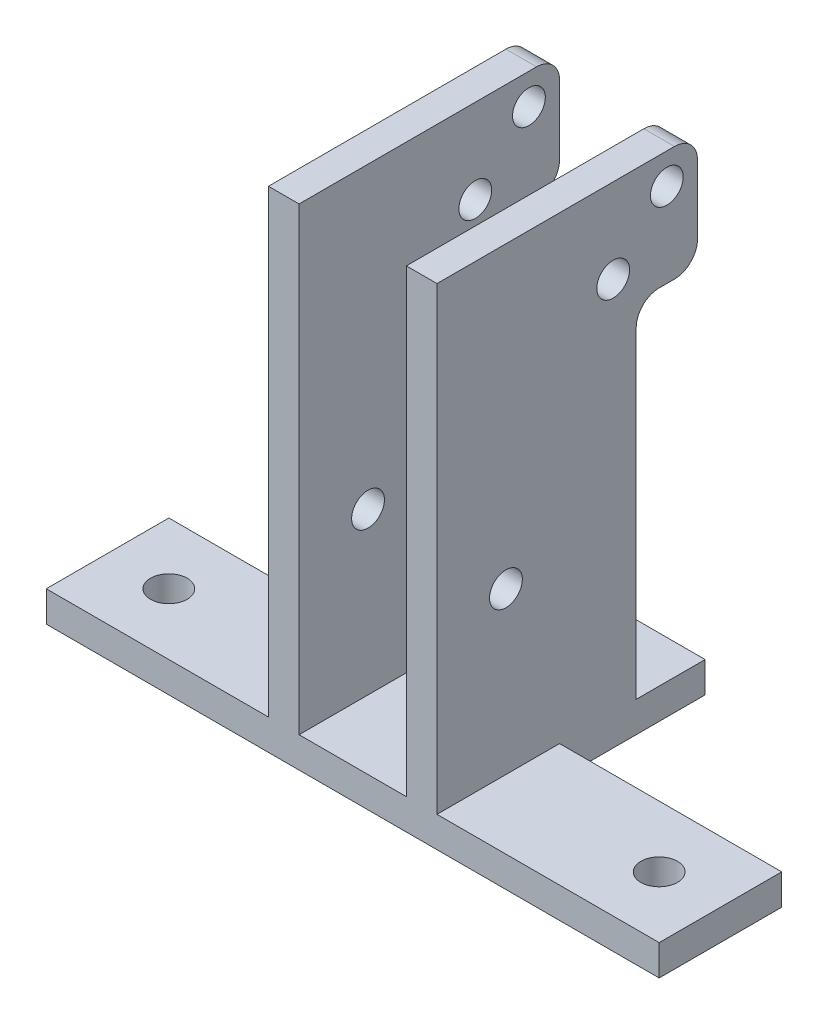
ISO-10303-21;
HEADER;
FILE_DESCRIPTION(('STEP AP214'),'2;1');
FILE_NAME('part.step','',(''),(''),'','','');
FILE_SCHEMA(('AUTOMOTIVE_DESIGN { 1 0 10303 214 1 1 1 1 }'));
ENDSEC;
DATA;
#1=APPLICATION_CONTEXT('core data for automotive mechanical design processes');
#2=APPLICATION_PROTOCOL_DEFINITION('international standard','automotive_design',2000,#1);
#3=PRODUCT_CONTEXT('',#1,'mechanical');
#4=PRODUCT('Part','Part','',(#3));
#5=PRODUCT_RELATED_PRODUCT_CATEGORY('part','',(#4));
#6=PRODUCT_DEFINITION_FORMATION('','',#4);
#7=PRODUCT_DEFINITION_CONTEXT('part definition',#1,'design');
#8=PRODUCT_DEFINITION('design','',#6,#7);
#9=PRODUCT_DEFINITION_SHAPE('','',#8);
#10=(LENGTH_UNIT() NAMED_UNIT(*) SI_UNIT(.MILLI.,.METRE.));
#11=(NAMED_UNIT(*) PLANE_ANGLE_UNIT() SI_UNIT($,.RADIAN.));
#12=(NAMED_UNIT(*) SI_UNIT($,.STERADIAN.) SOLID_ANGLE_UNIT());
#13=UNCERTAINTY_MEASURE_WITH_UNIT(LENGTH_MEASURE(1.E-05),#10,'distance_accuracy_value','');
#14=(GEOMETRIC_REPRESENTATION_CONTEXT(3) GLOBAL_UNCERTAINTY_ASSIGNED_CONTEXT((#13)) GLOBAL_UNIT_ASSIGNED_CONTEXT((#10,
#11,#12)) REPRESENTATION_CONTEXT('',''));
#15=CARTESIAN_POINT('',(0.,0.,0.));
#16=DIRECTION('',(0.,0.,1.));
#17=DIRECTION('',(1.,0.,0.));
#18=AXIS2_PLACEMENT_3D('',#15,#16,#17);
#19=CARTESIAN_POINT('',(-8.73125,44.45,-14.2875));
#20=DIRECTION('',(0.,0.,-1.));
#21=DIRECTION('',(-1.,0.,0.));
#22=AXIS2_PLACEMENT_3D('',#19,#20,#21);
#23=PLANE('',#22);
#24=DIRECTION('',(0.,-1.,0.));
#25=VECTOR('',#24,1.);
#26=CARTESIAN_POINT('',(-8.73125,44.45,-14.2875));
#27=LINE('',#26,#25);
#28=CARTESIAN_POINT('',(-8.73125,38.89375,-14.2875));
#29=VERTEX_POINT('',#28);
#30=CARTESIAN_POINT('',(-8.73125,3.175,-14.2875));
#31=VERTEX_POINT('',#30);
#32=EDGE_CURVE('E323',#29,#31,#27,.T.);
#33=ORIENTED_EDGE('',*,*,#32,.F.);
#34=DIRECTION('',(-1.,0.,0.));
#35=VECTOR('',#34,1.);
#36=CARTESIAN_POINT('',(-5.55625,38.89375,-14.2875));
#37=LINE('',#36,#35);
#38=CARTESIAN_POINT('',(-5.55625,38.89375,-14.2875));
#39=VERTEX_POINT('',#38);
#40=EDGE_CURVE('E233',#39,#29,#37,.T.);
#41=ORIENTED_EDGE('',*,*,#40,.F.);
#42=DIRECTION('',(0.,-1.,0.));
#43=VECTOR('',#42,1.);
#44=CARTESIAN_POINT('',(-5.55625,44.45,-14.2875));
#45=LINE('',#44,#43);
#46=CARTESIAN_POINT('',(-5.55625,3.175,-14.2875));
#47=VERTEX_POINT('',#46);
#48=EDGE_CURVE('E222',#39,#47,#45,.T.);
#49=ORIENTED_EDGE('',*,*,#48,.T.);
#50=DIRECTION('',(-1.,0.,0.));
#51=VECTOR('',#50,1.);
#52=CARTESIAN_POINT('',(0.,3.175,-14.2875));
#53=LINE('',#52,#51);
#54=EDGE_CURVE('E325',#47,#31,#53,.T.);
#55=ORIENTED_EDGE('',*,*,#54,.T.);
#56=EDGE_LOOP('',(#33,#41,#49,#55));
#57=FACE_BOUND('',#56,.T.);
#58=ADVANCED_FACE('F41',(#57),#23,.T.);
#59=CARTESIAN_POINT('',(0.,3.175,0.));
#60=DIRECTION('',(0.,1.,0.));
#61=DIRECTION('',(0.,0.,1.));
#62=AXIS2_PLACEMENT_3D('',#59,#60,#61);
#63=PLANE('',#62);
#64=DIRECTION('',(0.,0.,1.));
#65=VECTOR('',#64,1.);
#66=CARTESIAN_POINT('',(-8.73125,3.175,0.));
#67=LINE('',#66,#65);
#68=CARTESIAN_POINT('',(-8.73125,3.175,-6.35));
#69=VERTEX_POINT('',#68);
#70=CARTESIAN_POINT('',(-8.73125,3.175,6.35));
#71=VERTEX_POINT('',#70);
#72=EDGE_CURVE('E337',#69,#71,#67,.T.);
#73=ORIENTED_EDGE('',*,*,#72,.F.);
#74=DIRECTION('',(1.,0.,0.));
#75=VECTOR('',#74,1.);
#76=CARTESIAN_POINT('',(0.,3.175,-6.35));
#77=LINE('',#76,#75);
#78=CARTESIAN_POINT('',(-31.75,3.175,-6.35));
#79=VERTEX_POINT('',#78);
#80=EDGE_CURVE('E428',#79,#69,#77,.T.);
#81=ORIENTED_EDGE('',*,*,#80,.F.);
#82=DIRECTION('',(0.,0.,-1.));
#83=VECTOR('',#82,1.);
#84=CARTESIAN_POINT('',(-31.75,3.175,0.));
#85=LINE('',#84,#83);
#86=CARTESIAN_POINT('',(-31.75,3.175,6.35));
#87=VERTEX_POINT('',#86);
#88=EDGE_CURVE('E432',#87,#79,#85,.T.);
#89=ORIENTED_EDGE('',*,*,#88,.F.);
#90=DIRECTION('',(1.,0.,0.));
#91=VECTOR('',#90,1.);
#92=CARTESIAN_POINT('',(0.,3.175,6.35));
#93=LINE('',#92,#91);
#94=EDGE_CURVE('E419',#87,#71,#93,.T.);
#95=ORIENTED_EDGE('',*,*,#94,.T.);
#96=EDGE_LOOP('',(#73,#81,#89,#95));
#97=FACE_BOUND('',#96,.T.);
#98=CARTESIAN_POINT('',(-25.4,3.175,0.));
#99=DIRECTION('',(0.,-1.,0.));
#100=DIRECTION('',(0.,0.,-1.));
#101=AXIS2_PLACEMENT_3D('',#98,#99,#100);
#102=CIRCLE('',#101,1.89865);
#103=CARTESIAN_POINT('',(-25.4,3.175,-1.89865));
#104=VERTEX_POINT('',#103);
#105=EDGE_CURVE('E406',#104,#104,#102,.T.);
#106=ORIENTED_EDGE('',*,*,#105,.T.);
#107=EDGE_LOOP('',(#106));
#108=FACE_BOUND('',#107,.T.);
#109=ADVANCED_FACE('F629',(#97,#108),#63,.T.);
#110=DIRECTION('',(0.,0.,-1.));
#111=VECTOR('',#110,1.);
#112=CARTESIAN_POINT('',(8.73125,3.175,0.));
#113=LINE('',#112,#111);
#114=CARTESIAN_POINT('',(8.73125,3.175,6.35));
#115=VERTEX_POINT('',#114);
#116=CARTESIAN_POINT('',(8.73125,3.175,-6.35));
#117=VERTEX_POINT('',#116);
#118=EDGE_CURVE('E362',#115,#117,#113,.T.);
#119=ORIENTED_EDGE('',*,*,#118,.F.);
#120=CARTESIAN_POINT('',(31.75,3.175,6.35));
#121=VERTEX_POINT('',#120);
#122=EDGE_CURVE('E423',#115,#121,#93,.T.);
#123=ORIENTED_EDGE('',*,*,#122,.T.);
#124=DIRECTION('',(0.,0.,-1.));
#125=VECTOR('',#124,1.);
#126=CARTESIAN_POINT('',(31.75,3.175,0.));
#127=LINE('',#126,#125);
#128=CARTESIAN_POINT('',(31.75,3.175,-6.35));
#129=VERTEX_POINT('',#128);
#130=EDGE_CURVE('E422',#121,#129,#127,.T.);
#131=ORIENTED_EDGE('',*,*,#130,.T.);
#132=EDGE_CURVE('E427',#117,#129,#77,.T.);
#133=ORIENTED_EDGE('',*,*,#132,.F.);
#134=EDGE_LOOP('',(#119,#123,#131,#133));
#135=FACE_BOUND('',#134,.T.);
#136=CARTESIAN_POINT('',(25.4,3.175,0.));
#137=DIRECTION('',(0.,-1.,0.));
#138=DIRECTION('',(0.,0.,-1.));
#139=AXIS2_PLACEMENT_3D('',#136,#137,#138);
#140=CIRCLE('',#139,1.89865);
#141=CARTESIAN_POINT('',(25.4,3.175,-1.89865));
#142=VERTEX_POINT('',#141);
#143=EDGE_CURVE('E414',#142,#142,#140,.T.);
#144=ORIENTED_EDGE('',*,*,#143,.T.);
#145=EDGE_LOOP('',(#144));
#146=FACE_BOUND('',#145,.T.);
#147=ADVANCED_FACE('F573',(#135,#146),#63,.T.);
#148=CARTESIAN_POINT('',(0.,3.175,-6.35));
#149=DIRECTION('',(0.,0.,-1.));
#150=DIRECTION('',(-1.,0.,0.));
#151=AXIS2_PLACEMENT_3D('',#148,#149,#150);
#152=PLANE('',#151);
#153=DIRECTION('',(0.,-1.,0.));
#154=VECTOR('',#153,1.);
#155=CARTESIAN_POINT('',(8.73125,3.175,-6.35));
#156=LINE('',#155,#154);
#157=CARTESIAN_POINT('',(8.73125,0.,-6.35));
#158=VERTEX_POINT('',#157);
#159=EDGE_CURVE('E398',#117,#158,#156,.T.);
#160=ORIENTED_EDGE('',*,*,#159,.F.);
#161=ORIENTED_EDGE('',*,*,#132,.T.);
#162=DIRECTION('',(0.,-1.,0.));
#163=VECTOR('',#162,1.);
#164=CARTESIAN_POINT('',(31.75,3.175,-6.35));
#165=LINE('',#164,#163);
#166=CARTESIAN_POINT('',(31.75,0.,-6.35));
#167=VERTEX_POINT('',#166);
#168=EDGE_CURVE('E457',#129,#167,#165,.T.);
#169=ORIENTED_EDGE('',*,*,#168,.T.);
#170=DIRECTION('',(1.,0.,0.));
#171=VECTOR('',#170,1.);
#172=CARTESIAN_POINT('',(0.,0.,-6.35));
#173=LINE('',#172,#171);
#174=EDGE_CURVE('E443',#158,#167,#173,.T.);
#175=ORIENTED_EDGE('',*,*,#174,.F.);
#176=EDGE_LOOP('',(#160,#161,#169,#175));
#177=FACE_BOUND('',#176,.T.);
#178=ADVANCED_FACE('F541',(#177),#152,.T.);
#179=CARTESIAN_POINT('',(0.,3.175,6.35));
#180=DIRECTION('',(0.,0.,-1.));
#181=DIRECTION('',(-1.,0.,0.));
#182=AXIS2_PLACEMENT_3D('',#179,#180,#181);
#183=PLANE('',#182);
#184=CARTESIAN_POINT('',(-5.55625,3.175,6.35));
#185=VERTEX_POINT('',#184);
#186=CARTESIAN_POINT('',(5.55625,3.175,6.35));
#187=VERTEX_POINT('',#186);
#188=EDGE_CURVE('E217',#185,#187,#93,.T.);
#189=ORIENTED_EDGE('',*,*,#188,.F.);
#190=DIRECTION('',(0.,-1.,0.));
#191=VECTOR('',#190,1.);
#192=CARTESIAN_POINT('',(-5.55625,44.45,6.35));
#193=LINE('',#192,#191);
#194=CARTESIAN_POINT('',(-5.55625,50.8,6.35));
#195=VERTEX_POINT('',#194);
#196=EDGE_CURVE('E210',#195,#185,#193,.T.);
#197=ORIENTED_EDGE('',*,*,#196,.F.);
#198=DIRECTION('',(-1.,0.,0.));
#199=VECTOR('',#198,1.);
#200=CARTESIAN_POINT('',(-5.55625,50.8,6.35));
#201=LINE('',#200,#199);
#202=CARTESIAN_POINT('',(-8.73125,50.8,6.35));
#203=VERTEX_POINT('',#202);
#204=EDGE_CURVE('E214',#195,#203,#201,.T.);
#205=ORIENTED_EDGE('',*,*,#204,.T.);
#206=DIRECTION('',(0.,-1.,0.));
#207=VECTOR('',#206,1.);
#208=CARTESIAN_POINT('',(-8.73125,44.45,6.35));
#209=LINE('',#208,#207);
#210=EDGE_CURVE('E221',#203,#71,#209,.T.);
#211=ORIENTED_EDGE('',*,*,#210,.T.);
#212=ORIENTED_EDGE('',*,*,#94,.F.);
#213=DIRECTION('',(0.,-1.,0.));
#214=VECTOR('',#213,1.);
#215=CARTESIAN_POINT('',(-31.75,3.175,6.35));
#216=LINE('',#215,#214);
#217=CARTESIAN_POINT('',(-31.75,0.,6.35));
#218=VERTEX_POINT('',#217);
#219=EDGE_CURVE('E436',#87,#218,#216,.T.);
#220=ORIENTED_EDGE('',*,*,#219,.T.);
#221=DIRECTION('',(1.,0.,0.));
#222=VECTOR('',#221,1.);
#223=CARTESIAN_POINT('',(0.,0.,6.35));
#224=LINE('',#223,#222);
#225=CARTESIAN_POINT('',(31.75,0.,6.35));
#226=VERTEX_POINT('',#225);
#227=EDGE_CURVE('E418',#218,#226,#224,.T.);
#228=ORIENTED_EDGE('',*,*,#227,.T.);
#229=DIRECTION('',(0.,-1.,0.));
#230=VECTOR('',#229,1.);
#231=CARTESIAN_POINT('',(31.75,3.175,6.35));
#232=LINE('',#231,#230);
#233=EDGE_CURVE('E461',#121,#226,#232,.T.);
#234=ORIENTED_EDGE('',*,*,#233,.F.);
#235=ORIENTED_EDGE('',*,*,#122,.F.);
#236=DIRECTION('',(0.,-1.,0.));
#237=VECTOR('',#236,1.);
#238=CARTESIAN_POINT('',(8.73125,44.45,6.35));
#239=LINE('',#238,#237);
#240=CARTESIAN_POINT('',(8.73125,50.8,6.35));
#241=VERTEX_POINT('',#240);
#242=EDGE_CURVE('E341',#241,#115,#239,.T.);
#243=ORIENTED_EDGE('',*,*,#242,.F.);
#244=DIRECTION('',(1.,0.,0.));
#245=VECTOR('',#244,1.);
#246=CARTESIAN_POINT('',(5.55625,50.8,6.35));
#247=LINE('',#246,#245);
#248=CARTESIAN_POINT('',(5.55625,50.8,6.35));
#249=VERTEX_POINT('',#248);
#250=EDGE_CURVE('E279',#249,#241,#247,.T.);
#251=ORIENTED_EDGE('',*,*,#250,.F.);
#252=DIRECTION('',(0.,-1.,0.));
#253=VECTOR('',#252,1.);
#254=CARTESIAN_POINT('',(5.55625,44.45,6.35));
#255=LINE('',#254,#253);
#256=EDGE_CURVE('E349',#249,#187,#255,.T.);
#257=ORIENTED_EDGE('',*,*,#256,.T.);
#258=EDGE_LOOP('',(#189,#197,#205,#211,#212,#220,#228,#234,#235,#243,#251,#257));
#259=FACE_BOUND('',#258,.T.);
#260=ADVANCED_FACE('F212',(#259),#183,.F.);
#261=CARTESIAN_POINT('',(31.75,3.175,0.));
#262=DIRECTION('',(-1.,0.,0.));
#263=DIRECTION('',(0.,0.,1.));
#264=AXIS2_PLACEMENT_3D('',#261,#262,#263);
#265=PLANE('',#264);
#266=DIRECTION('',(0.,0.,-1.));
#267=VECTOR('',#266,1.);
#268=CARTESIAN_POINT('',(31.75,0.,0.));
#269=LINE('',#268,#267);
#270=EDGE_CURVE('E439',#226,#167,#269,.T.);
#271=ORIENTED_EDGE('',*,*,#270,.T.);
#272=ORIENTED_EDGE('',*,*,#168,.F.);
#273=ORIENTED_EDGE('',*,*,#130,.F.);
#274=ORIENTED_EDGE('',*,*,#233,.T.);
#275=EDGE_LOOP('',(#271,#272,#273,#274));
#276=FACE_BOUND('',#275,.T.);
#277=ADVANCED_FACE('F545',(#276),#265,.F.);
#278=DIRECTION('',(0.,1.,0.));
#279=VECTOR('',#278,1.);
#280=CARTESIAN_POINT('',(-8.73125,3.175,-6.35));
#281=LINE('',#280,#279);
#282=CARTESIAN_POINT('',(-8.73125,0.,-6.35));
#283=VERTEX_POINT('',#282);
#284=EDGE_CURVE('E391',#283,#69,#281,.T.);
#285=ORIENTED_EDGE('',*,*,#284,.F.);
#286=CARTESIAN_POINT('',(-31.75,0.,-6.35));
#287=VERTEX_POINT('',#286);
#288=EDGE_CURVE('E444',#287,#283,#173,.T.);
#289=ORIENTED_EDGE('',*,*,#288,.F.);
#290=DIRECTION('',(0.,-1.,0.));
#291=VECTOR('',#290,1.);
#292=CARTESIAN_POINT('',(-31.75,3.175,-6.35));
#293=LINE('',#292,#291);
#294=EDGE_CURVE('E454',#79,#287,#293,.T.);
#295=ORIENTED_EDGE('',*,*,#294,.F.);
#296=ORIENTED_EDGE('',*,*,#80,.T.);
#297=EDGE_LOOP('',(#285,#289,#295,#296));
#298=FACE_BOUND('',#297,.T.);
#299=ADVANCED_FACE('F557',(#298),#152,.T.);
#300=CARTESIAN_POINT('',(-31.75,3.175,0.));
#301=DIRECTION('',(-1.,0.,0.));
#302=DIRECTION('',(0.,0.,1.));
#303=AXIS2_PLACEMENT_3D('',#300,#301,#302);
#304=PLANE('',#303);
#305=DIRECTION('',(0.,0.,-1.));
#306=VECTOR('',#305,1.);
#307=CARTESIAN_POINT('',(-31.75,0.,0.));
#308=LINE('',#307,#306);
#309=EDGE_CURVE('E448',#218,#287,#308,.T.);
#310=ORIENTED_EDGE('',*,*,#309,.F.);
#311=ORIENTED_EDGE('',*,*,#219,.F.);
#312=ORIENTED_EDGE('',*,*,#88,.T.);
#313=ORIENTED_EDGE('',*,*,#294,.T.);
#314=EDGE_LOOP('',(#310,#311,#312,#313));
#315=FACE_BOUND('',#314,.T.);
#316=ADVANCED_FACE('F551',(#315),#304,.T.);
#317=DIRECTION('',(0.,0.,-1.));
#318=VECTOR('',#317,1.);
#319=CARTESIAN_POINT('',(-5.55625,3.175,0.));
#320=LINE('',#319,#318);
#321=EDGE_CURVE('E334',#185,#47,#320,.T.);
#322=ORIENTED_EDGE('',*,*,#321,.F.);
#323=ORIENTED_EDGE('',*,*,#188,.T.);
#324=DIRECTION('',(0.,0.,1.));
#325=VECTOR('',#324,1.);
#326=CARTESIAN_POINT('',(5.55625,3.175,0.));
#327=LINE('',#326,#325);
#328=CARTESIAN_POINT('',(5.55625,3.175,-14.2875));
#329=VERTEX_POINT('',#328);
#330=EDGE_CURVE('E358',#329,#187,#327,.T.);
#331=ORIENTED_EDGE('',*,*,#330,.F.);
#332=DIRECTION('',(-1.,0.,0.));
#333=VECTOR('',#332,1.);
#334=CARTESIAN_POINT('',(0.,3.175,-14.2875));
#335=LINE('',#334,#333);
#336=CARTESIAN_POINT('',(8.73125,3.175,-14.2875));
#337=VERTEX_POINT('',#336);
#338=EDGE_CURVE('E345',#337,#329,#335,.T.);
#339=ORIENTED_EDGE('',*,*,#338,.F.);
#340=DIRECTION('',(0.,0.,1.));
#341=VECTOR('',#340,1.);
#342=CARTESIAN_POINT('',(8.73125,3.175,6.35));
#343=LINE('',#342,#341);
#344=CARTESIAN_POINT('',(8.73125,3.175,-21.43125));
#345=VERTEX_POINT('',#344);
#346=EDGE_CURVE('E367',#345,#337,#343,.T.);
#347=ORIENTED_EDGE('',*,*,#346,.F.);
#348=DIRECTION('',(1.,0.,0.));
#349=VECTOR('',#348,1.);
#350=CARTESIAN_POINT('',(8.73125,3.175,-21.43125));
#351=LINE('',#350,#349);
#352=CARTESIAN_POINT('',(-8.73125,3.175,-21.43125));
#353=VERTEX_POINT('',#352);
#354=EDGE_CURVE('E375',#353,#345,#351,.T.);
#355=ORIENTED_EDGE('',*,*,#354,.F.);
#356=DIRECTION('',(0.,0.,-1.));
#357=VECTOR('',#356,1.);
#358=CARTESIAN_POINT('',(-8.73125,3.175,6.35));
#359=LINE('',#358,#357);
#360=EDGE_CURVE('E371',#31,#353,#359,.T.);
#361=ORIENTED_EDGE('',*,*,#360,.F.);
#362=ORIENTED_EDGE('',*,*,#54,.F.);
#363=EDGE_LOOP('',(#322,#323,#331,#339,#347,#355,#361,#362));
#364=FACE_BOUND('',#363,.T.);
#365=ADVANCED_FACE('F611',(#364),#63,.T.);
#366=CARTESIAN_POINT('',(0.,0.,0.));
#367=DIRECTION('',(0.,1.,0.));
#368=DIRECTION('',(0.,0.,1.));
#369=AXIS2_PLACEMENT_3D('',#366,#367,#368);
#370=PLANE('',#369);
#371=ORIENTED_EDGE('',*,*,#270,.F.);
#372=ORIENTED_EDGE('',*,*,#227,.F.);
#373=ORIENTED_EDGE('',*,*,#309,.T.);
#374=ORIENTED_EDGE('',*,*,#288,.T.);
#375=DIRECTION('',(0.,0.,-1.));
#376=VECTOR('',#375,1.);
#377=CARTESIAN_POINT('',(-8.73125,0.,6.35));
#378=LINE('',#377,#376);
#379=CARTESIAN_POINT('',(-8.73125,0.,-21.43125));
#380=VERTEX_POINT('',#379);
#381=EDGE_CURVE('E382',#283,#380,#378,.T.);
#382=ORIENTED_EDGE('',*,*,#381,.T.);
#383=DIRECTION('',(1.,0.,0.));
#384=VECTOR('',#383,1.);
#385=CARTESIAN_POINT('',(8.73125,0.,-21.43125));
#386=LINE('',#385,#384);
#387=CARTESIAN_POINT('',(8.73125,0.,-21.43125));
#388=VERTEX_POINT('',#387);
#389=EDGE_CURVE('E372',#380,#388,#386,.T.);
#390=ORIENTED_EDGE('',*,*,#389,.T.);
#391=DIRECTION('',(0.,0.,1.));
#392=VECTOR('',#391,1.);
#393=CARTESIAN_POINT('',(8.73125,0.,6.35));
#394=LINE('',#393,#392);
#395=EDGE_CURVE('E366',#388,#158,#394,.T.);
#396=ORIENTED_EDGE('',*,*,#395,.T.);
#397=ORIENTED_EDGE('',*,*,#174,.T.);
#398=EDGE_LOOP('',(#371,#372,#373,#374,#382,#390,#396,#397));
#399=FACE_BOUND('',#398,.T.);
#400=CARTESIAN_POINT('',(25.4,0.,0.));
#401=DIRECTION('',(0.,-1.,0.));
#402=DIRECTION('',(0.,0.,-1.));
#403=AXIS2_PLACEMENT_3D('',#400,#401,#402);
#404=CIRCLE('',#403,1.89864999999999);
#405=CARTESIAN_POINT('',(25.4,0.,-1.89864999999999));
#406=VERTEX_POINT('',#405);
#407=EDGE_CURVE('E410',#406,#406,#404,.T.);
#408=ORIENTED_EDGE('',*,*,#407,.F.);
#409=EDGE_LOOP('',(#408));
#410=FACE_BOUND('',#409,.T.);
#411=CARTESIAN_POINT('',(-25.4,0.,0.));
#412=DIRECTION('',(0.,-1.,0.));
#413=DIRECTION('',(0.,0.,-1.));
#414=AXIS2_PLACEMENT_3D('',#411,#412,#413);
#415=CIRCLE('',#414,1.89864999999999);
#416=CARTESIAN_POINT('',(-25.4,0.,-1.89864999999999));
#417=VERTEX_POINT('',#416);
#418=EDGE_CURVE('E402',#417,#417,#415,.T.);
#419=ORIENTED_EDGE('',*,*,#418,.F.);
#420=EDGE_LOOP('',(#419));
#421=FACE_BOUND('',#420,.T.);
#422=ADVANCED_FACE('F535',(#399,#410,#421),#370,.F.);
#423=CARTESIAN_POINT('',(25.4,0.,0.));
#424=DIRECTION('',(0.,-1.,0.));
#425=DIRECTION('',(0.,0.,-1.));
#426=AXIS2_PLACEMENT_3D('',#423,#424,#425);
#427=CYLINDRICAL_SURFACE('',#426,1.89864999999999);
#428=ORIENTED_EDGE('',*,*,#143,.F.);
#429=EDGE_LOOP('',(#428));
#430=FACE_BOUND('',#429,.T.);
#431=ORIENTED_EDGE('',*,*,#407,.T.);
#432=EDGE_LOOP('',(#431));
#433=FACE_BOUND('',#432,.T.);
#434=ADVANCED_FACE('F638',(#430,#433),#427,.F.);
#435=CARTESIAN_POINT('',(-25.4,0.,0.));
#436=DIRECTION('',(0.,-1.,0.));
#437=DIRECTION('',(0.,0.,-1.));
#438=AXIS2_PLACEMENT_3D('',#435,#436,#437);
#439=CYLINDRICAL_SURFACE('',#438,1.89864999999999);
#440=ORIENTED_EDGE('',*,*,#105,.F.);
#441=EDGE_LOOP('',(#440));
#442=FACE_BOUND('',#441,.T.);
#443=ORIENTED_EDGE('',*,*,#418,.T.);
#444=EDGE_LOOP('',(#443));
#445=FACE_BOUND('',#444,.T.);
#446=ADVANCED_FACE('F635',(#442,#445),#439,.F.);
#447=CARTESIAN_POINT('',(8.73125,3.175,6.35));
#448=DIRECTION('',(1.,0.,0.));
#449=DIRECTION('',(0.,0.,-1.));
#450=AXIS2_PLACEMENT_3D('',#447,#448,#449);
#451=PLANE('',#450);
#452=CARTESIAN_POINT('',(8.73125,47.625,-17.4625));
#453=DIRECTION('',(1.,0.,0.));
#454=DIRECTION('',(0.,0.,-1.));
#455=AXIS2_PLACEMENT_3D('',#452,#453,#454);
#456=CIRCLE('',#455,1.69999999999999);
#457=CARTESIAN_POINT('',(8.73125,47.625,-19.1625));
#458=VERTEX_POINT('',#457);
#459=EDGE_CURVE('E260',#458,#458,#456,.T.);
#460=ORIENTED_EDGE('',*,*,#459,.F.);
#461=EDGE_LOOP('',(#460));
#462=FACE_BOUND('',#461,.T.);
#463=DIRECTION('',(0.,-1.,0.));
#464=VECTOR('',#463,1.);
#465=CARTESIAN_POINT('',(8.73125,0.,-20.6375));
#466=LINE('',#465,#464);
#467=CARTESIAN_POINT('',(8.73125,48.41875,-20.6375));
#468=VERTEX_POINT('',#467);
#469=CARTESIAN_POINT('',(8.73125,41.275,-20.6375));
#470=VERTEX_POINT('',#469);
#471=EDGE_CURVE('E284',#468,#470,#466,.T.);
#472=ORIENTED_EDGE('',*,*,#471,.F.);
#473=CARTESIAN_POINT('',(8.73125,48.41875,-18.25625));
#474=DIRECTION('',(1.,0.,0.));
#475=DIRECTION('',(0.,0.,-1.));
#476=AXIS2_PLACEMENT_3D('',#473,#474,#475);
#477=CIRCLE('',#476,2.38125);
#478=CARTESIAN_POINT('',(8.73125,50.8,-18.25625));
#479=VERTEX_POINT('',#478);
#480=EDGE_CURVE('E478',#468,#479,#477,.T.);
#481=ORIENTED_EDGE('',*,*,#480,.T.);
#482=DIRECTION('',(0.,0.,-1.));
#483=VECTOR('',#482,1.);
#484=CARTESIAN_POINT('',(8.73125,50.8,0.));
#485=LINE('',#484,#483);
#486=EDGE_CURVE('E271',#241,#479,#485,.T.);
#487=ORIENTED_EDGE('',*,*,#486,.F.);
#488=ORIENTED_EDGE('',*,*,#242,.T.);
#489=ORIENTED_EDGE('',*,*,#118,.T.);
#490=ORIENTED_EDGE('',*,*,#159,.T.);
#491=ORIENTED_EDGE('',*,*,#395,.F.);
#492=DIRECTION('',(0.,-1.,0.));
#493=VECTOR('',#492,1.);
#494=CARTESIAN_POINT('',(8.73125,3.175,-21.43125));
#495=LINE('',#494,#493);
#496=EDGE_CURVE('E388',#345,#388,#495,.T.);
#497=ORIENTED_EDGE('',*,*,#496,.F.);
#498=ORIENTED_EDGE('',*,*,#346,.T.);
#499=DIRECTION('',(0.,-1.,0.));
#500=VECTOR('',#499,1.);
#501=CARTESIAN_POINT('',(8.73125,44.45,-14.2875));
#502=LINE('',#501,#500);
#503=CARTESIAN_POINT('',(8.73125,36.5125,-14.2875));
#504=VERTEX_POINT('',#503);
#505=EDGE_CURVE('E342',#504,#337,#502,.T.);
#506=ORIENTED_EDGE('',*,*,#505,.F.);
#507=CARTESIAN_POINT('',(8.73125,36.5125,-16.66875));
#508=DIRECTION('',(1.,0.,0.));
#509=DIRECTION('',(0.,0.,-1.));
#510=AXIS2_PLACEMENT_3D('',#507,#508,#509);
#511=CIRCLE('',#510,2.38125);
#512=CARTESIAN_POINT('',(8.73125,38.89375,-16.66875));
#513=VERTEX_POINT('',#512);
#514=EDGE_CURVE('E501',#504,#513,#511,.F.);
#515=ORIENTED_EDGE('',*,*,#514,.T.);
#516=DIRECTION('',(0.,0.,-1.));
#517=VECTOR('',#516,1.);
#518=CARTESIAN_POINT('',(8.73125,38.89375,0.));
#519=LINE('',#518,#517);
#520=CARTESIAN_POINT('',(8.73125,38.89375,-18.25625));
#521=VERTEX_POINT('',#520);
#522=EDGE_CURVE('E280',#513,#521,#519,.T.);
#523=ORIENTED_EDGE('',*,*,#522,.T.);
#524=CARTESIAN_POINT('',(8.73125,41.275,-18.25625));
#525=DIRECTION('',(1.,0.,0.));
#526=DIRECTION('',(0.,0.,-1.));
#527=AXIS2_PLACEMENT_3D('',#524,#525,#526);
#528=CIRCLE('',#527,2.38125);
#529=EDGE_CURVE('E475',#521,#470,#528,.T.);
#530=ORIENTED_EDGE('',*,*,#529,.T.);
#531=EDGE_LOOP('',(#472,#481,#487,#488,#489,#490,#491,#497,#498,#506,#515,#523,#530));
#532=FACE_BOUND('',#531,.T.);
#533=CARTESIAN_POINT('',(8.73125,19.84375,-0.793750000000014));
#534=DIRECTION('',(1.,0.,0.));
#535=DIRECTION('',(0.,0.,-1.));
#536=AXIS2_PLACEMENT_3D('',#533,#534,#535);
#537=CIRCLE('',#536,1.7);
#538=CARTESIAN_POINT('',(8.73125,19.84375,-2.49375000000001));
#539=VERTEX_POINT('',#538);
#540=EDGE_CURVE('E294',#539,#539,#537,.T.);
#541=ORIENTED_EDGE('',*,*,#540,.F.);
#542=EDGE_LOOP('',(#541));
#543=FACE_BOUND('',#542,.T.);
#544=CARTESIAN_POINT('',(8.73125,42.06875,-11.90625));
#545=DIRECTION('',(1.,0.,0.));
#546=DIRECTION('',(0.,0.,-1.));
#547=AXIS2_PLACEMENT_3D('',#544,#545,#546);
#548=CIRCLE('',#547,1.7);
#549=CARTESIAN_POINT('',(8.73125,42.06875,-13.60625));
#550=VERTEX_POINT('',#549);
#551=EDGE_CURVE('E307',#550,#550,#548,.T.);
#552=ORIENTED_EDGE('',*,*,#551,.F.);
#553=EDGE_LOOP('',(#552));
#554=FACE_BOUND('',#553,.T.);
#555=ADVANCED_FACE('F570',(#462,#532,#543,#554),#451,.T.);
#556=CARTESIAN_POINT('',(8.73125,3.175,-21.43125));
#557=DIRECTION('',(0.,0.,-1.));
#558=DIRECTION('',(-1.,0.,0.));
#559=AXIS2_PLACEMENT_3D('',#556,#557,#558);
#560=PLANE('',#559);
#561=ORIENTED_EDGE('',*,*,#389,.F.);
#562=DIRECTION('',(0.,-1.,0.));
#563=VECTOR('',#562,1.);
#564=CARTESIAN_POINT('',(-8.73125,3.175,-21.43125));
#565=LINE('',#564,#563);
#566=EDGE_CURVE('E379',#353,#380,#565,.T.);
#567=ORIENTED_EDGE('',*,*,#566,.F.);
#568=ORIENTED_EDGE('',*,*,#354,.T.);
#569=ORIENTED_EDGE('',*,*,#496,.T.);
#570=EDGE_LOOP('',(#561,#567,#568,#569));
#571=FACE_BOUND('',#570,.T.);
#572=ADVANCED_FACE('F566',(#571),#560,.T.);
#573=CARTESIAN_POINT('',(-8.73125,3.175,6.35));
#574=DIRECTION('',(-1.,0.,0.));
#575=DIRECTION('',(0.,0.,1.));
#576=AXIS2_PLACEMENT_3D('',#573,#574,#575);
#577=PLANE('',#576);
#578=CARTESIAN_POINT('',(-8.73125,47.625,-17.4625));
#579=DIRECTION('',(-1.,0.,0.));
#580=DIRECTION('',(0.,0.,1.));
#581=AXIS2_PLACEMENT_3D('',#578,#579,#580);
#582=CIRCLE('',#581,1.69999999999999);
#583=CARTESIAN_POINT('',(-8.73125,47.625,-15.7625));
#584=VERTEX_POINT('',#583);
#585=EDGE_CURVE('E718',#584,#584,#582,.T.);
#586=ORIENTED_EDGE('',*,*,#585,.F.);
#587=EDGE_LOOP('',(#586));
#588=FACE_BOUND('',#587,.T.);
#589=DIRECTION('',(0.,0.,-1.));
#590=VECTOR('',#589,1.);
#591=CARTESIAN_POINT('',(-8.73125,50.8,0.));
#592=LINE('',#591,#590);
#593=CARTESIAN_POINT('',(-8.73125,50.8,-18.25625));
#594=VERTEX_POINT('',#593);
#595=EDGE_CURVE('E231',#203,#594,#592,.T.);
#596=ORIENTED_EDGE('',*,*,#595,.T.);
#597=CARTESIAN_POINT('',(-8.73125,48.41875,-18.25625));
#598=DIRECTION('',(-1.,0.,0.));
#599=DIRECTION('',(0.,0.,1.));
#600=AXIS2_PLACEMENT_3D('',#597,#598,#599);
#601=CIRCLE('',#600,2.38125);
#602=CARTESIAN_POINT('',(-8.73125,48.41875,-20.6375));
#603=VERTEX_POINT('',#602);
#604=EDGE_CURVE('E516',#594,#603,#601,.T.);
#605=ORIENTED_EDGE('',*,*,#604,.T.);
#606=DIRECTION('',(0.,-1.,0.));
#607=VECTOR('',#606,1.);
#608=CARTESIAN_POINT('',(-8.73125,0.,-20.6375));
#609=LINE('',#608,#607);
#610=CARTESIAN_POINT('',(-8.73125,41.275,-20.6375));
#611=VERTEX_POINT('',#610);
#612=EDGE_CURVE('E246',#603,#611,#609,.T.);
#613=ORIENTED_EDGE('',*,*,#612,.T.);
#614=CARTESIAN_POINT('',(-8.73125,41.275,-18.25625));
#615=DIRECTION('',(-1.,0.,0.));
#616=DIRECTION('',(0.,0.,1.));
#617=AXIS2_PLACEMENT_3D('',#614,#615,#616);
#618=CIRCLE('',#617,2.38125);
#619=CARTESIAN_POINT('',(-8.73125,38.89375,-18.25625));
#620=VERTEX_POINT('',#619);
#621=EDGE_CURVE('E513',#611,#620,#618,.T.);
#622=ORIENTED_EDGE('',*,*,#621,.T.);
#623=DIRECTION('',(0.,0.,-1.));
#624=VECTOR('',#623,1.);
#625=CARTESIAN_POINT('',(-8.73125,38.89375,0.));
#626=LINE('',#625,#624);
#627=EDGE_CURVE('E241',#29,#620,#626,.T.);
#628=ORIENTED_EDGE('',*,*,#627,.F.);
#629=ORIENTED_EDGE('',*,*,#32,.T.);
#630=ORIENTED_EDGE('',*,*,#360,.T.);
#631=ORIENTED_EDGE('',*,*,#566,.T.);
#632=ORIENTED_EDGE('',*,*,#381,.F.);
#633=ORIENTED_EDGE('',*,*,#284,.T.);
#634=ORIENTED_EDGE('',*,*,#72,.T.);
#635=ORIENTED_EDGE('',*,*,#210,.F.);
#636=EDGE_LOOP('',(#596,#605,#613,#622,#628,#629,#630,#631,#632,#633,#634,#635));
#637=FACE_BOUND('',#636,.T.);
#638=CARTESIAN_POINT('',(-8.73125,19.84375,-0.793750000000012));
#639=DIRECTION('',(-1.,0.,0.));
#640=DIRECTION('',(0.,0.,1.));
#641=AXIS2_PLACEMENT_3D('',#638,#639,#640);
#642=CIRCLE('',#641,1.7);
#643=CARTESIAN_POINT('',(-8.73125,19.84375,0.906249999999985));
#644=VERTEX_POINT('',#643);
#645=EDGE_CURVE('E298',#644,#644,#642,.T.);
#646=ORIENTED_EDGE('',*,*,#645,.F.);
#647=EDGE_LOOP('',(#646));
#648=FACE_BOUND('',#647,.T.);
#649=CARTESIAN_POINT('',(-8.73125,42.06875,-11.90625));
#650=DIRECTION('',(-1.,0.,0.));
#651=DIRECTION('',(0.,0.,1.));
#652=AXIS2_PLACEMENT_3D('',#649,#650,#651);
#653=CIRCLE('',#652,1.7);
#654=CARTESIAN_POINT('',(-8.73125,42.06875,-10.20625));
#655=VERTEX_POINT('',#654);
#656=EDGE_CURVE('E311',#655,#655,#653,.T.);
#657=ORIENTED_EDGE('',*,*,#656,.F.);
#658=EDGE_LOOP('',(#657));
#659=FACE_BOUND('',#658,.T.);
#660=ADVANCED_FACE('F561',(#588,#637,#648,#659),#577,.T.);
#661=CARTESIAN_POINT('',(8.73125,44.45,-14.2875));
#662=DIRECTION('',(0.,0.,-1.));
#663=DIRECTION('',(-1.,0.,0.));
#664=AXIS2_PLACEMENT_3D('',#661,#662,#663);
#665=PLANE('',#664);
#666=DIRECTION('',(0.,-1.,0.));
#667=VECTOR('',#666,1.);
#668=CARTESIAN_POINT('',(5.55625,44.45,-14.2875));
#669=LINE('',#668,#667);
#670=CARTESIAN_POINT('',(5.55625,36.5125,-14.2875));
#671=VERTEX_POINT('',#670);
#672=EDGE_CURVE('E346',#671,#329,#669,.T.);
#673=ORIENTED_EDGE('',*,*,#672,.F.);
#674=DIRECTION('',(1.,0.,0.));
#675=VECTOR('',#674,1.);
#676=CARTESIAN_POINT('',(8.73125,36.5125,-14.2875));
#677=LINE('',#676,#675);
#678=EDGE_CURVE('E497',#671,#504,#677,.T.);
#679=ORIENTED_EDGE('',*,*,#678,.T.);
#680=ORIENTED_EDGE('',*,*,#505,.T.);
#681=ORIENTED_EDGE('',*,*,#338,.T.);
#682=EDGE_LOOP('',(#673,#679,#680,#681));
#683=FACE_BOUND('',#682,.T.);
#684=ADVANCED_FACE('F608',(#683),#665,.T.);
#685=CARTESIAN_POINT('',(5.55625,44.45,6.35));
#686=DIRECTION('',(-1.,0.,0.));
#687=DIRECTION('',(0.,0.,1.));
#688=AXIS2_PLACEMENT_3D('',#685,#686,#687);
#689=PLANE('',#688);
#690=CARTESIAN_POINT('',(5.55625,47.625,-17.4625));
#691=DIRECTION('',(-1.,0.,0.));
#692=DIRECTION('',(0.,0.,1.));
#693=AXIS2_PLACEMENT_3D('',#690,#691,#692);
#694=CIRCLE('',#693,1.69999999999999);
#695=CARTESIAN_POINT('',(5.55625,47.625,-15.7625));
#696=VERTEX_POINT('',#695);
#697=EDGE_CURVE('E265',#696,#696,#694,.T.);
#698=ORIENTED_EDGE('',*,*,#697,.F.);
#699=EDGE_LOOP('',(#698));
#700=FACE_BOUND('',#699,.T.);
#701=DIRECTION('',(0.,0.,-1.));
#702=VECTOR('',#701,1.);
#703=CARTESIAN_POINT('',(5.55625,50.8,0.));
#704=LINE('',#703,#702);
#705=CARTESIAN_POINT('',(5.55625,50.8,-18.25625));
#706=VERTEX_POINT('',#705);
#707=EDGE_CURVE('E275',#249,#706,#704,.T.);
#708=ORIENTED_EDGE('',*,*,#707,.T.);
#709=CARTESIAN_POINT('',(5.55625,48.41875,-18.25625));
#710=DIRECTION('',(-1.,0.,0.));
#711=DIRECTION('',(0.,0.,1.));
#712=AXIS2_PLACEMENT_3D('',#709,#710,#711);
#713=CIRCLE('',#712,2.38125);
#714=CARTESIAN_POINT('',(5.55625,48.41875,-20.6375));
#715=VERTEX_POINT('',#714);
#716=EDGE_CURVE('E487',#706,#715,#713,.T.);
#717=ORIENTED_EDGE('',*,*,#716,.T.);
#718=DIRECTION('',(0.,-1.,0.));
#719=VECTOR('',#718,1.);
#720=CARTESIAN_POINT('',(5.55625,0.,-20.6375));
#721=LINE('',#720,#719);
#722=CARTESIAN_POINT('',(5.55625,41.275,-20.6375));
#723=VERTEX_POINT('',#722);
#724=EDGE_CURVE('E270',#715,#723,#721,.T.);
#725=ORIENTED_EDGE('',*,*,#724,.T.);
#726=CARTESIAN_POINT('',(5.55625,41.275,-18.25625));
#727=DIRECTION('',(-1.,0.,0.));
#728=DIRECTION('',(0.,0.,1.));
#729=AXIS2_PLACEMENT_3D('',#726,#727,#728);
#730=CIRCLE('',#729,2.38125);
#731=CARTESIAN_POINT('',(5.55625,38.89375,-18.25625));
#732=VERTEX_POINT('',#731);
#733=EDGE_CURVE('E484',#723,#732,#730,.T.);
#734=ORIENTED_EDGE('',*,*,#733,.T.);
#735=DIRECTION('',(0.,0.,-1.));
#736=VECTOR('',#735,1.);
#737=CARTESIAN_POINT('',(5.55625,38.89375,0.));
#738=LINE('',#737,#736);
#739=CARTESIAN_POINT('',(5.55625,38.89375,-16.66875));
#740=VERTEX_POINT('',#739);
#741=EDGE_CURVE('E266',#740,#732,#738,.T.);
#742=ORIENTED_EDGE('',*,*,#741,.F.);
#743=CARTESIAN_POINT('',(5.55625,36.5125,-16.66875));
#744=DIRECTION('',(-1.,0.,0.));
#745=DIRECTION('',(0.,0.,1.));
#746=AXIS2_PLACEMENT_3D('',#743,#744,#745);
#747=CIRCLE('',#746,2.38125);
#748=EDGE_CURVE('E504',#740,#671,#747,.F.);
#749=ORIENTED_EDGE('',*,*,#748,.T.);
#750=ORIENTED_EDGE('',*,*,#672,.T.);
#751=ORIENTED_EDGE('',*,*,#330,.T.);
#752=ORIENTED_EDGE('',*,*,#256,.F.);
#753=EDGE_LOOP('',(#708,#717,#725,#734,#742,#749,#750,#751,#752));
#754=FACE_BOUND('',#753,.T.);
#755=CARTESIAN_POINT('',(5.55625,19.84375,-0.793750000000014));
#756=DIRECTION('',(-1.,0.,0.));
#757=DIRECTION('',(0.,0.,1.));
#758=AXIS2_PLACEMENT_3D('',#755,#756,#757);
#759=CIRCLE('',#758,1.7);
#760=CARTESIAN_POINT('',(5.55625,19.84375,0.906249999999983));
#761=VERTEX_POINT('',#760);
#762=EDGE_CURVE('E303',#761,#761,#759,.T.);
#763=ORIENTED_EDGE('',*,*,#762,.F.);
#764=EDGE_LOOP('',(#763));
#765=FACE_BOUND('',#764,.T.);
#766=CARTESIAN_POINT('',(5.55625,42.06875,-11.90625));
#767=DIRECTION('',(-1.,0.,0.));
#768=DIRECTION('',(0.,0.,1.));
#769=AXIS2_PLACEMENT_3D('',#766,#767,#768);
#770=CIRCLE('',#769,1.7);
#771=CARTESIAN_POINT('',(5.55625,42.06875,-10.20625));
#772=VERTEX_POINT('',#771);
#773=EDGE_CURVE('E319',#772,#772,#770,.T.);
#774=ORIENTED_EDGE('',*,*,#773,.F.);
#775=EDGE_LOOP('',(#774));
#776=FACE_BOUND('',#775,.T.);
#777=ADVANCED_FACE('F583',(#700,#754,#765,#776),#689,.T.);
#778=CARTESIAN_POINT('',(-5.55625,44.45,6.35));
#779=DIRECTION('',(1.,0.,0.));
#780=DIRECTION('',(0.,0.,-1.));
#781=AXIS2_PLACEMENT_3D('',#778,#779,#780);
#782=PLANE('',#781);
#783=CARTESIAN_POINT('',(-5.55625,47.625,-17.4625));
#784=DIRECTION('',(1.,0.,0.));
#785=DIRECTION('',(0.,0.,-1.));
#786=AXIS2_PLACEMENT_3D('',#783,#784,#785);
#787=CIRCLE('',#786,1.69999999999999);
#788=CARTESIAN_POINT('',(-5.55625,47.625,-19.1625));
#789=VERTEX_POINT('',#788);
#790=EDGE_CURVE('E249',#789,#789,#787,.T.);
#791=ORIENTED_EDGE('',*,*,#790,.F.);
#792=EDGE_LOOP('',(#791));
#793=FACE_BOUND('',#792,.T.);
#794=DIRECTION('',(0.,-1.,0.));
#795=VECTOR('',#794,1.);
#796=CARTESIAN_POINT('',(-5.55625,0.,-20.6375));
#797=LINE('',#796,#795);
#798=CARTESIAN_POINT('',(-5.55625,48.41875,-20.6375));
#799=VERTEX_POINT('',#798);
#800=CARTESIAN_POINT('',(-5.55625,41.275,-20.6375));
#801=VERTEX_POINT('',#800);
#802=EDGE_CURVE('E240',#799,#801,#797,.T.);
#803=ORIENTED_EDGE('',*,*,#802,.F.);
#804=CARTESIAN_POINT('',(-5.55625,48.41875,-18.25625));
#805=DIRECTION('',(1.,0.,0.));
#806=DIRECTION('',(0.,0.,-1.));
#807=AXIS2_PLACEMENT_3D('',#804,#805,#806);
#808=CIRCLE('',#807,2.38125);
#809=CARTESIAN_POINT('',(-5.55625,50.8,-18.25625));
#810=VERTEX_POINT('',#809);
#811=EDGE_CURVE('E50',#799,#810,#808,.T.);
#812=ORIENTED_EDGE('',*,*,#811,.T.);
#813=DIRECTION('',(0.,0.,-1.));
#814=VECTOR('',#813,1.);
#815=CARTESIAN_POINT('',(-5.55625,50.8,0.));
#816=LINE('',#815,#814);
#817=EDGE_CURVE('E228',#195,#810,#816,.T.);
#818=ORIENTED_EDGE('',*,*,#817,.F.);
#819=ORIENTED_EDGE('',*,*,#196,.T.);
#820=ORIENTED_EDGE('',*,*,#321,.T.);
#821=ORIENTED_EDGE('',*,*,#48,.F.);
#822=DIRECTION('',(0.,0.,-1.));
#823=VECTOR('',#822,1.);
#824=CARTESIAN_POINT('',(-5.55625,38.89375,0.));
#825=LINE('',#824,#823);
#826=CARTESIAN_POINT('',(-5.55625,38.89375,-18.25625));
#827=VERTEX_POINT('',#826);
#828=EDGE_CURVE('E234',#39,#827,#825,.T.);
#829=ORIENTED_EDGE('',*,*,#828,.T.);
#830=CARTESIAN_POINT('',(-5.55625,41.275,-18.25625));
#831=DIRECTION('',(1.,0.,0.));
#832=DIRECTION('',(0.,0.,-1.));
#833=AXIS2_PLACEMENT_3D('',#830,#831,#832);
#834=CIRCLE('',#833,2.38125);
#835=EDGE_CURVE('E62',#827,#801,#834,.T.);
#836=ORIENTED_EDGE('',*,*,#835,.T.);
#837=EDGE_LOOP('',(#803,#812,#818,#819,#820,#821,#829,#836));
#838=FACE_BOUND('',#837,.T.);
#839=CARTESIAN_POINT('',(-5.55625,19.84375,-0.793750000000013));
#840=DIRECTION('',(1.,0.,0.));
#841=DIRECTION('',(0.,0.,-1.));
#842=AXIS2_PLACEMENT_3D('',#839,#840,#841);
#843=CIRCLE('',#842,1.7);
#844=CARTESIAN_POINT('',(-5.55625,19.84375,-2.49375000000001));
#845=VERTEX_POINT('',#844);
#846=EDGE_CURVE('E299',#845,#845,#843,.T.);
#847=ORIENTED_EDGE('',*,*,#846,.F.);
#848=EDGE_LOOP('',(#847));
#849=FACE_BOUND('',#848,.T.);
#850=CARTESIAN_POINT('',(-5.55625,42.06875,-11.90625));
#851=DIRECTION('',(1.,0.,0.));
#852=DIRECTION('',(0.,0.,-1.));
#853=AXIS2_PLACEMENT_3D('',#850,#851,#852);
#854=CIRCLE('',#853,1.7);
#855=CARTESIAN_POINT('',(-5.55625,42.06875,-13.60625));
#856=VERTEX_POINT('',#855);
#857=EDGE_CURVE('E315',#856,#856,#854,.T.);
#858=ORIENTED_EDGE('',*,*,#857,.F.);
#859=EDGE_LOOP('',(#858));
#860=FACE_BOUND('',#859,.T.);
#861=ADVANCED_FACE('F236',(#793,#838,#849,#860),#782,.T.);
#862=CARTESIAN_POINT('',(8.73125,42.06875,-11.90625));
#863=DIRECTION('',(1.,0.,0.));
#864=DIRECTION('',(0.,0.,-1.));
#865=AXIS2_PLACEMENT_3D('',#862,#863,#864);
#866=CYLINDRICAL_SURFACE('',#865,1.7);
#867=ORIENTED_EDGE('',*,*,#773,.T.);
#868=EDGE_LOOP('',(#867));
#869=FACE_BOUND('',#868,.T.);
#870=ORIENTED_EDGE('',*,*,#551,.T.);
#871=EDGE_LOOP('',(#870));
#872=FACE_BOUND('',#871,.T.);
#873=ADVANCED_FACE('F699',(#869,#872),#866,.F.);
#874=ORIENTED_EDGE('',*,*,#857,.T.);
#875=EDGE_LOOP('',(#874));
#876=FACE_BOUND('',#875,.T.);
#877=ORIENTED_EDGE('',*,*,#656,.T.);
#878=EDGE_LOOP('',(#877));
#879=FACE_BOUND('',#878,.T.);
#880=ADVANCED_FACE('F696',(#876,#879),#866,.F.);
#881=CARTESIAN_POINT('',(8.73125,19.84375,-0.793750000000014));
#882=DIRECTION('',(1.,0.,0.));
#883=DIRECTION('',(0.,0.,-1.));
#884=AXIS2_PLACEMENT_3D('',#881,#882,#883);
#885=CYLINDRICAL_SURFACE('',#884,1.7);
#886=ORIENTED_EDGE('',*,*,#846,.T.);
#887=EDGE_LOOP('',(#886));
#888=FACE_BOUND('',#887,.T.);
#889=ORIENTED_EDGE('',*,*,#645,.T.);
#890=EDGE_LOOP('',(#889));
#891=FACE_BOUND('',#890,.T.);
#892=ADVANCED_FACE('F694',(#888,#891),#885,.F.);
#893=ORIENTED_EDGE('',*,*,#762,.T.);
#894=EDGE_LOOP('',(#893));
#895=FACE_BOUND('',#894,.T.);
#896=ORIENTED_EDGE('',*,*,#540,.T.);
#897=EDGE_LOOP('',(#896));
#898=FACE_BOUND('',#897,.T.);
#899=ADVANCED_FACE('F689',(#895,#898),#885,.F.);
#900=CARTESIAN_POINT('',(5.55625,50.8,0.));
#901=DIRECTION('',(0.,-1.,0.));
#902=DIRECTION('',(0.,0.,-1.));
#903=AXIS2_PLACEMENT_3D('',#900,#901,#902);
#904=PLANE('',#903);
#905=ORIENTED_EDGE('',*,*,#486,.T.);
#906=DIRECTION('',(1.,0.,0.));
#907=VECTOR('',#906,1.);
#908=CARTESIAN_POINT('',(5.55625,50.8,-18.25625));
#909=LINE('',#908,#907);
#910=EDGE_CURVE('E481',#479,#706,#909,.F.);
#911=ORIENTED_EDGE('',*,*,#910,.T.);
#912=ORIENTED_EDGE('',*,*,#707,.F.);
#913=ORIENTED_EDGE('',*,*,#250,.T.);
#914=EDGE_LOOP('',(#905,#911,#912,#913));
#915=FACE_BOUND('',#914,.T.);
#916=ADVANCED_FACE('F579',(#915),#904,.F.);
#917=CARTESIAN_POINT('',(5.55625,0.,-20.6375));
#918=DIRECTION('',(0.,0.,1.));
#919=DIRECTION('',(0.,-1.,0.));
#920=AXIS2_PLACEMENT_3D('',#917,#918,#919);
#921=PLANE('',#920);
#922=ORIENTED_EDGE('',*,*,#724,.F.);
#923=DIRECTION('',(1.,0.,0.));
#924=VECTOR('',#923,1.);
#925=CARTESIAN_POINT('',(5.55625,48.41875,-20.6375));
#926=LINE('',#925,#924);
#927=EDGE_CURVE('E471',#715,#468,#926,.T.);
#928=ORIENTED_EDGE('',*,*,#927,.T.);
#929=ORIENTED_EDGE('',*,*,#471,.T.);
#930=DIRECTION('',(1.,0.,0.));
#931=VECTOR('',#930,1.);
#932=CARTESIAN_POINT('',(5.55625,41.275,-20.6375));
#933=LINE('',#932,#931);
#934=EDGE_CURVE('E465',#470,#723,#933,.F.);
#935=ORIENTED_EDGE('',*,*,#934,.T.);
#936=EDGE_LOOP('',(#922,#928,#929,#935));
#937=FACE_BOUND('',#936,.T.);
#938=ADVANCED_FACE('F590',(#937),#921,.F.);
#939=CARTESIAN_POINT('',(5.55625,38.89375,0.));
#940=DIRECTION('',(0.,-1.,0.));
#941=DIRECTION('',(0.,0.,-1.));
#942=AXIS2_PLACEMENT_3D('',#939,#940,#941);
#943=PLANE('',#942);
#944=ORIENTED_EDGE('',*,*,#741,.T.);
#945=DIRECTION('',(1.,0.,0.));
#946=VECTOR('',#945,1.);
#947=CARTESIAN_POINT('',(8.73125,38.89375,-18.25625));
#948=LINE('',#947,#946);
#949=EDGE_CURVE('E493',#732,#521,#948,.T.);
#950=ORIENTED_EDGE('',*,*,#949,.T.);
#951=ORIENTED_EDGE('',*,*,#522,.F.);
#952=DIRECTION('',(1.,0.,0.));
#953=VECTOR('',#952,1.);
#954=CARTESIAN_POINT('',(5.55625,38.89375,-16.66875));
#955=LINE('',#954,#953);
#956=EDGE_CURVE('E490',#513,#740,#955,.F.);
#957=ORIENTED_EDGE('',*,*,#956,.T.);
#958=EDGE_LOOP('',(#944,#950,#951,#957));
#959=FACE_BOUND('',#958,.T.);
#960=ADVANCED_FACE('F598',(#959),#943,.T.);
#961=CARTESIAN_POINT('',(5.55625,48.41875,-18.25625));
#962=DIRECTION('',(1.,0.,0.));
#963=DIRECTION('',(0.,0.,-1.));
#964=AXIS2_PLACEMENT_3D('',#961,#962,#963);
#965=CYLINDRICAL_SURFACE('',#964,2.38125);
#966=ORIENTED_EDGE('',*,*,#716,.F.);
#967=ORIENTED_EDGE('',*,*,#910,.F.);
#968=ORIENTED_EDGE('',*,*,#480,.F.);
#969=ORIENTED_EDGE('',*,*,#927,.F.);
#970=EDGE_LOOP('',(#966,#967,#968,#969));
#971=FACE_BOUND('',#970,.T.);
#972=ADVANCED_FACE('F588',(#971),#965,.T.);
#973=CARTESIAN_POINT('',(5.55625,41.275,-18.25625));
#974=DIRECTION('',(-1.,0.,0.));
#975=DIRECTION('',(0.,0.,1.));
#976=AXIS2_PLACEMENT_3D('',#973,#974,#975);
#977=CYLINDRICAL_SURFACE('',#976,2.38125);
#978=ORIENTED_EDGE('',*,*,#733,.F.);
#979=ORIENTED_EDGE('',*,*,#934,.F.);
#980=ORIENTED_EDGE('',*,*,#529,.F.);
#981=ORIENTED_EDGE('',*,*,#949,.F.);
#982=EDGE_LOOP('',(#978,#979,#980,#981));
#983=FACE_BOUND('',#982,.T.);
#984=ADVANCED_FACE('F596',(#983),#977,.T.);
#985=CARTESIAN_POINT('',(8.73125,36.5125,-16.66875));
#986=DIRECTION('',(-1.,0.,0.));
#987=DIRECTION('',(0.,0.,1.));
#988=AXIS2_PLACEMENT_3D('',#985,#986,#987);
#989=CYLINDRICAL_SURFACE('',#988,2.38125);
#990=ORIENTED_EDGE('',*,*,#748,.F.);
#991=ORIENTED_EDGE('',*,*,#956,.F.);
#992=ORIENTED_EDGE('',*,*,#514,.F.);
#993=ORIENTED_EDGE('',*,*,#678,.F.);
#994=EDGE_LOOP('',(#990,#991,#992,#993));
#995=FACE_BOUND('',#994,.T.);
#996=ADVANCED_FACE('F605',(#995),#989,.F.);
#997=CARTESIAN_POINT('',(8.73125,47.625,-17.4625));
#998=DIRECTION('',(1.,0.,0.));
#999=DIRECTION('',(0.,0.,-1.));
#1000=AXIS2_PLACEMENT_3D('',#997,#998,#999);
#1001=CYLINDRICAL_SURFACE('',#1000,1.69999999999999);
#1002=ORIENTED_EDGE('',*,*,#697,.T.);
#1003=EDGE_LOOP('',(#1002));
#1004=FACE_BOUND('',#1003,.T.);
#1005=ORIENTED_EDGE('',*,*,#459,.T.);
#1006=EDGE_LOOP('',(#1005));
#1007=FACE_BOUND('',#1006,.T.);
#1008=ADVANCED_FACE('F674',(#1004,#1007),#1001,.F.);
#1009=CARTESIAN_POINT('',(-5.55625,38.89375,0.));
#1010=DIRECTION('',(0.,1.,0.));
#1011=DIRECTION('',(0.,0.,1.));
#1012=AXIS2_PLACEMENT_3D('',#1009,#1010,#1011);
#1013=PLANE('',#1012);
#1014=ORIENTED_EDGE('',*,*,#627,.T.);
#1015=DIRECTION('',(-1.,0.,0.));
#1016=VECTOR('',#1015,1.);
#1017=CARTESIAN_POINT('',(-5.55625,38.89375,-18.25625));
#1018=LINE('',#1017,#1016);
#1019=EDGE_CURVE('E11',#620,#827,#1018,.F.);
#1020=ORIENTED_EDGE('',*,*,#1019,.T.);
#1021=ORIENTED_EDGE('',*,*,#828,.F.);
#1022=ORIENTED_EDGE('',*,*,#40,.T.);
#1023=EDGE_LOOP('',(#1014,#1020,#1021,#1022));
#1024=FACE_BOUND('',#1023,.T.);
#1025=ADVANCED_FACE('F619',(#1024),#1013,.F.);
#1026=CARTESIAN_POINT('',(-5.55625,0.,-20.6375));
#1027=DIRECTION('',(0.,0.,-1.));
#1028=DIRECTION('',(0.,1.,0.));
#1029=AXIS2_PLACEMENT_3D('',#1026,#1027,#1028);
#1030=PLANE('',#1029);
#1031=ORIENTED_EDGE('',*,*,#612,.F.);
#1032=DIRECTION('',(-1.,0.,0.));
#1033=VECTOR('',#1032,1.);
#1034=CARTESIAN_POINT('',(-5.55625,48.41875,-20.6375));
#1035=LINE('',#1034,#1033);
#1036=EDGE_CURVE('E523',#603,#799,#1035,.F.);
#1037=ORIENTED_EDGE('',*,*,#1036,.T.);
#1038=ORIENTED_EDGE('',*,*,#802,.T.);
#1039=DIRECTION('',(-1.,0.,0.));
#1040=VECTOR('',#1039,1.);
#1041=CARTESIAN_POINT('',(-8.73125,41.275,-20.6375));
#1042=LINE('',#1041,#1040);
#1043=EDGE_CURVE('E519',#801,#611,#1042,.T.);
#1044=ORIENTED_EDGE('',*,*,#1043,.T.);
#1045=EDGE_LOOP('',(#1031,#1037,#1038,#1044));
#1046=FACE_BOUND('',#1045,.T.);
#1047=ADVANCED_FACE('F624',(#1046),#1030,.T.);
#1048=CARTESIAN_POINT('',(-5.55625,50.8,0.));
#1049=DIRECTION('',(0.,1.,0.));
#1050=DIRECTION('',(0.,0.,1.));
#1051=AXIS2_PLACEMENT_3D('',#1048,#1049,#1050);
#1052=PLANE('',#1051);
#1053=ORIENTED_EDGE('',*,*,#817,.T.);
#1054=DIRECTION('',(-1.,0.,0.));
#1055=VECTOR('',#1054,1.);
#1056=CARTESIAN_POINT('',(-5.55625,50.8,-18.25625));
#1057=LINE('',#1056,#1055);
#1058=EDGE_CURVE('E507',#810,#594,#1057,.T.);
#1059=ORIENTED_EDGE('',*,*,#1058,.T.);
#1060=ORIENTED_EDGE('',*,*,#595,.F.);
#1061=ORIENTED_EDGE('',*,*,#204,.F.);
#1062=EDGE_LOOP('',(#1053,#1059,#1060,#1061));
#1063=FACE_BOUND('',#1062,.T.);
#1064=ADVANCED_FACE('F226',(#1063),#1052,.T.);
#1065=CARTESIAN_POINT('',(-5.55625,48.41875,-18.25625));
#1066=DIRECTION('',(-1.,0.,0.));
#1067=DIRECTION('',(0.,0.,1.));
#1068=AXIS2_PLACEMENT_3D('',#1065,#1066,#1067);
#1069=CYLINDRICAL_SURFACE('',#1068,2.38125);
#1070=ORIENTED_EDGE('',*,*,#811,.F.);
#1071=ORIENTED_EDGE('',*,*,#1036,.F.);
#1072=ORIENTED_EDGE('',*,*,#604,.F.);
#1073=ORIENTED_EDGE('',*,*,#1058,.F.);
#1074=EDGE_LOOP('',(#1070,#1071,#1072,#1073));
#1075=FACE_BOUND('',#1074,.T.);
#1076=ADVANCED_FACE('F627',(#1075),#1069,.T.);
#1077=CARTESIAN_POINT('',(-5.55625,41.275,-18.25625));
#1078=DIRECTION('',(1.,0.,0.));
#1079=DIRECTION('',(0.,0.,-1.));
#1080=AXIS2_PLACEMENT_3D('',#1077,#1078,#1079);
#1081=CYLINDRICAL_SURFACE('',#1080,2.38125);
#1082=ORIENTED_EDGE('',*,*,#835,.F.);
#1083=ORIENTED_EDGE('',*,*,#1019,.F.);
#1084=ORIENTED_EDGE('',*,*,#621,.F.);
#1085=ORIENTED_EDGE('',*,*,#1043,.F.);
#1086=EDGE_LOOP('',(#1082,#1083,#1084,#1085));
#1087=FACE_BOUND('',#1086,.T.);
#1088=ADVANCED_FACE('F43',(#1087),#1081,.T.);
#1089=CARTESIAN_POINT('',(-8.73125,47.625,-17.4625));
#1090=DIRECTION('',(-1.,0.,0.));
#1091=DIRECTION('',(0.,0.,1.));
#1092=AXIS2_PLACEMENT_3D('',#1089,#1090,#1091);
#1093=CYLINDRICAL_SURFACE('',#1092,1.69999999999999);
#1094=ORIENTED_EDGE('',*,*,#790,.T.);
#1095=EDGE_LOOP('',(#1094));
#1096=FACE_BOUND('',#1095,.T.);
#1097=ORIENTED_EDGE('',*,*,#585,.T.);
#1098=EDGE_LOOP('',(#1097));
#1099=FACE_BOUND('',#1098,.T.);
#1100=ADVANCED_FACE('F723',(#1096,#1099),#1093,.F.);
#1101=CLOSED_SHELL('',(#58,#109,#147,#178,#260,#277,#299,#316,#365,#422,#434,#446,#555,#572,
#660,#684,#777,#861,#873,#880,#892,#899,#916,#938,#960,#972,#984,#996,#1008,#1025,#1047,#1064,
#1076,#1088,#1100));
#1102=MANIFOLD_SOLID_BREP('B2',#1101);
#1103=ADVANCED_BREP_SHAPE_REPRESENTATION('',(#18,#1102),#14);
#1104=SHAPE_DEFINITION_REPRESENTATION(#9,#1103);
ENDSEC;
END-ISO-10303-21;
